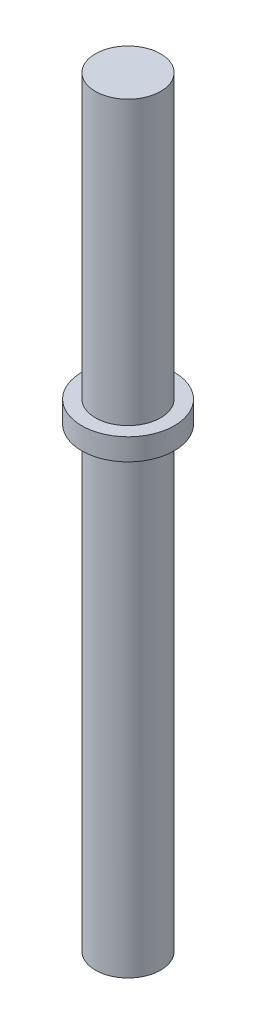
ISO-10303-21;
HEADER;
FILE_DESCRIPTION(('STEP AP214'),'2;1');
FILE_NAME('part.step','',(''),(''),'','','');
FILE_SCHEMA(('AUTOMOTIVE_DESIGN { 1 0 10303 214 1 1 1 1 }'));
ENDSEC;
DATA;
#1=APPLICATION_CONTEXT('core data for automotive mechanical design processes');
#2=APPLICATION_PROTOCOL_DEFINITION('international standard','automotive_design',2000,#1);
#3=PRODUCT_CONTEXT('',#1,'mechanical');
#4=PRODUCT('Part','Part','',(#3));
#5=PRODUCT_RELATED_PRODUCT_CATEGORY('part','',(#4));
#6=PRODUCT_DEFINITION_FORMATION('','',#4);
#7=PRODUCT_DEFINITION_CONTEXT('part definition',#1,'design');
#8=PRODUCT_DEFINITION('design','',#6,#7);
#9=PRODUCT_DEFINITION_SHAPE('','',#8);
#10=(LENGTH_UNIT() NAMED_UNIT(*) SI_UNIT(.MILLI.,.METRE.));
#11=(NAMED_UNIT(*) PLANE_ANGLE_UNIT() SI_UNIT($,.RADIAN.));
#12=(NAMED_UNIT(*) SI_UNIT($,.STERADIAN.) SOLID_ANGLE_UNIT());
#13=UNCERTAINTY_MEASURE_WITH_UNIT(LENGTH_MEASURE(1.E-05),#10,'distance_accuracy_value','');
#14=(GEOMETRIC_REPRESENTATION_CONTEXT(3) GLOBAL_UNCERTAINTY_ASSIGNED_CONTEXT((#13)) GLOBAL_UNIT_ASSIGNED_CONTEXT((#10,
#11,#12)) REPRESENTATION_CONTEXT('',''));
#15=CARTESIAN_POINT('',(0.,0.,0.));
#16=DIRECTION('',(0.,0.,1.));
#17=DIRECTION('',(1.,0.,0.));
#18=AXIS2_PLACEMENT_3D('',#15,#16,#17);
#19=CARTESIAN_POINT('',(0.,35.,0.));
#20=DIRECTION('',(0.,-1.,0.));
#21=DIRECTION('',(0.,0.,-1.));
#22=AXIS2_PLACEMENT_3D('',#19,#20,#21);
#23=CYLINDRICAL_SURFACE('',#22,1.5);
#24=CARTESIAN_POINT('',(0.,35.,0.));
#25=DIRECTION('',(0.,1.,0.));
#26=DIRECTION('',(0.,0.,1.));
#27=AXIS2_PLACEMENT_3D('',#24,#25,#26);
#28=CIRCLE('',#27,1.5);
#29=CARTESIAN_POINT('',(0.,35.,1.5));
#30=VERTEX_POINT('',#29);
#31=EDGE_CURVE('E51',#30,#30,#28,.T.);
#32=ORIENTED_EDGE('',*,*,#31,.F.);
#33=EDGE_LOOP('',(#32));
#34=FACE_BOUND('',#33,.T.);
#35=CARTESIAN_POINT('',(0.,22.,0.));
#36=DIRECTION('',(0.,-1.,0.));
#37=DIRECTION('',(0.,0.,-1.));
#38=AXIS2_PLACEMENT_3D('',#35,#36,#37);
#39=CIRCLE('',#38,1.5);
#40=CARTESIAN_POINT('',(0.,22.,-1.5));
#41=VERTEX_POINT('',#40);
#42=EDGE_CURVE('E10',#41,#41,#39,.T.);
#43=ORIENTED_EDGE('',*,*,#42,.F.);
#44=EDGE_LOOP('',(#43));
#45=FACE_BOUND('',#44,.T.);
#46=ADVANCED_FACE('F43',(#34,#45),#23,.T.);
#47=CARTESIAN_POINT('',(0.,35.,0.));
#48=DIRECTION('',(0.,1.,0.));
#49=DIRECTION('',(0.,0.,1.));
#50=AXIS2_PLACEMENT_3D('',#47,#48,#49);
#51=PLANE('',#50);
#52=ORIENTED_EDGE('',*,*,#31,.T.);
#53=EDGE_LOOP('',(#52));
#54=FACE_BOUND('',#53,.T.);
#55=ADVANCED_FACE('F85',(#54),#51,.T.);
#56=CARTESIAN_POINT('',(0.,22.,0.));
#57=DIRECTION('',(0.,-1.,0.));
#58=DIRECTION('',(0.,0.,-1.));
#59=AXIS2_PLACEMENT_3D('',#56,#57,#58);
#60=CYLINDRICAL_SURFACE('',#59,2.1297613609269);
#61=CARTESIAN_POINT('',(0.,22.,0.));
#62=DIRECTION('',(0.,-1.,0.));
#63=DIRECTION('',(0.,0.,-1.));
#64=AXIS2_PLACEMENT_3D('',#61,#62,#63);
#65=CIRCLE('',#64,2.1297613609269);
#66=CARTESIAN_POINT('',(0.,22.,-2.1297613609269));
#67=VERTEX_POINT('',#66);
#68=EDGE_CURVE('E69',#67,#67,#65,.T.);
#69=ORIENTED_EDGE('',*,*,#68,.T.);
#70=EDGE_LOOP('',(#69));
#71=FACE_BOUND('',#70,.T.);
#72=CARTESIAN_POINT('',(0.,21.,0.));
#73=DIRECTION('',(0.,-1.,0.));
#74=DIRECTION('',(0.,0.,-1.));
#75=AXIS2_PLACEMENT_3D('',#72,#73,#74);
#76=CIRCLE('',#75,2.1297613609269);
#77=CARTESIAN_POINT('',(0.,21.,-2.1297613609269));
#78=VERTEX_POINT('',#77);
#79=EDGE_CURVE('E65',#78,#78,#76,.T.);
#80=ORIENTED_EDGE('',*,*,#79,.F.);
#81=EDGE_LOOP('',(#80));
#82=FACE_BOUND('',#81,.T.);
#83=ADVANCED_FACE('F82',(#71,#82),#60,.T.);
#84=CARTESIAN_POINT('',(0.,22.,0.));
#85=DIRECTION('',(0.,-1.,0.));
#86=DIRECTION('',(0.,0.,-1.));
#87=AXIS2_PLACEMENT_3D('',#84,#85,#86);
#88=PLANE('',#87);
#89=ORIENTED_EDGE('',*,*,#42,.T.);
#90=EDGE_LOOP('',(#89));
#91=FACE_BOUND('',#90,.T.);
#92=ORIENTED_EDGE('',*,*,#68,.F.);
#93=EDGE_LOOP('',(#92));
#94=FACE_BOUND('',#93,.T.);
#95=ADVANCED_FACE('F84',(#91,#94),#88,.F.);
#96=CARTESIAN_POINT('',(0.,21.,0.));
#97=DIRECTION('',(0.,-1.,0.));
#98=DIRECTION('',(0.,0.,-1.));
#99=AXIS2_PLACEMENT_3D('',#96,#97,#98);
#100=PLANE('',#99);
#101=CARTESIAN_POINT('',(0.,21.,0.));
#102=DIRECTION('',(0.,-1.,0.));
#103=DIRECTION('',(0.,0.,-1.));
#104=AXIS2_PLACEMENT_3D('',#101,#102,#103);
#105=CIRCLE('',#104,1.5);
#106=CARTESIAN_POINT('',(0.,21.,-1.5));
#107=VERTEX_POINT('',#106);
#108=EDGE_CURVE('E62',#107,#107,#105,.T.);
#109=ORIENTED_EDGE('',*,*,#108,.F.);
#110=EDGE_LOOP('',(#109));
#111=FACE_BOUND('',#110,.T.);
#112=ORIENTED_EDGE('',*,*,#79,.T.);
#113=EDGE_LOOP('',(#112));
#114=FACE_BOUND('',#113,.T.);
#115=ADVANCED_FACE('F80',(#111,#114),#100,.T.);
#116=CARTESIAN_POINT('',(0.,0.,0.));
#117=DIRECTION('',(0.,1.,0.));
#118=DIRECTION('',(0.,0.,1.));
#119=AXIS2_PLACEMENT_3D('',#116,#117,#118);
#120=PLANE('',#119);
#121=CARTESIAN_POINT('',(0.,0.,0.));
#122=DIRECTION('',(0.,1.,0.));
#123=DIRECTION('',(0.,0.,1.));
#124=AXIS2_PLACEMENT_3D('',#121,#122,#123);
#125=CIRCLE('',#124,1.5);
#126=CARTESIAN_POINT('',(0.,0.,1.5));
#127=VERTEX_POINT('',#126);
#128=EDGE_CURVE('E56',#127,#127,#125,.T.);
#129=ORIENTED_EDGE('',*,*,#128,.F.);
#130=EDGE_LOOP('',(#129));
#131=FACE_BOUND('',#130,.T.);
#132=ADVANCED_FACE('F101',(#131),#120,.F.);
#133=ORIENTED_EDGE('',*,*,#108,.T.);
#134=EDGE_LOOP('',(#133));
#135=FACE_BOUND('',#134,.T.);
#136=ORIENTED_EDGE('',*,*,#128,.T.);
#137=EDGE_LOOP('',(#136));
#138=FACE_BOUND('',#137,.T.);
#139=ADVANCED_FACE('F45',(#135,#138),#23,.T.);
#140=CLOSED_SHELL('',(#46,#55,#83,#95,#115,#132,#139));
#141=MANIFOLD_SOLID_BREP('B2',#140);
#142=ADVANCED_BREP_SHAPE_REPRESENTATION('',(#18,#141),#14);
#143=SHAPE_DEFINITION_REPRESENTATION(#9,#142);
ENDSEC;
END-ISO-10303-21;
